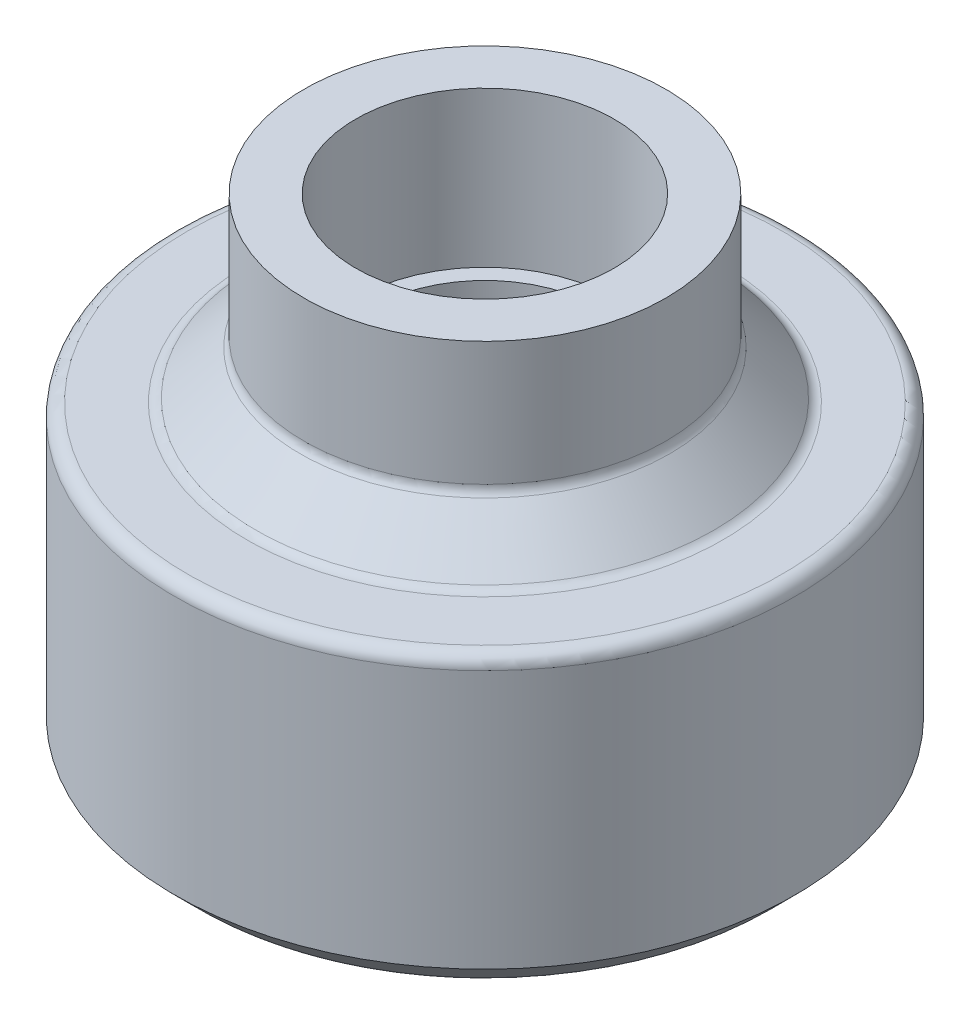
ISO-10303-21;
HEADER;
FILE_DESCRIPTION(('STEP AP214'),'2;1');
FILE_NAME('part.step','',(''),(''),'','','');
FILE_SCHEMA(('AUTOMOTIVE_DESIGN { 1 0 10303 214 1 1 1 1 }'));
ENDSEC;
DATA;
#1=APPLICATION_CONTEXT('core data for automotive mechanical design processes');
#2=APPLICATION_PROTOCOL_DEFINITION('international standard','automotive_design',2000,#1);
#3=PRODUCT_CONTEXT('',#1,'mechanical');
#4=PRODUCT('Part','Part','',(#3));
#5=PRODUCT_RELATED_PRODUCT_CATEGORY('part','',(#4));
#6=PRODUCT_DEFINITION_FORMATION('','',#4);
#7=PRODUCT_DEFINITION_CONTEXT('part definition',#1,'design');
#8=PRODUCT_DEFINITION('design','',#6,#7);
#9=PRODUCT_DEFINITION_SHAPE('','',#8);
#10=(LENGTH_UNIT() NAMED_UNIT(*) SI_UNIT(.MILLI.,.METRE.));
#11=(NAMED_UNIT(*) PLANE_ANGLE_UNIT() SI_UNIT($,.RADIAN.));
#12=(NAMED_UNIT(*) SI_UNIT($,.STERADIAN.) SOLID_ANGLE_UNIT());
#13=UNCERTAINTY_MEASURE_WITH_UNIT(LENGTH_MEASURE(1.E-05),#10,'distance_accuracy_value','');
#14=(GEOMETRIC_REPRESENTATION_CONTEXT(3) GLOBAL_UNCERTAINTY_ASSIGNED_CONTEXT((#13)) GLOBAL_UNIT_ASSIGNED_CONTEXT((#10,
#11,#12)) REPRESENTATION_CONTEXT('',''));
#15=CARTESIAN_POINT('',(0.,0.,0.));
#16=DIRECTION('',(0.,0.,1.));
#17=DIRECTION('',(1.,0.,0.));
#18=AXIS2_PLACEMENT_3D('',#15,#16,#17);
#19=CARTESIAN_POINT('',(0.,0.,0.));
#20=DIRECTION('',(0.,1.,0.));
#21=DIRECTION('',(-1.,0.,0.));
#22=AXIS2_PLACEMENT_3D('',#19,#20,#21);
#23=PLANE('',#22);
#24=CARTESIAN_POINT('',(0.,0.,0.));
#25=DIRECTION('',(0.,1.,0.));
#26=DIRECTION('',(0.,0.,1.));
#27=AXIS2_PLACEMENT_3D('',#24,#25,#26);
#28=CIRCLE('',#27,5.55625);
#29=CARTESIAN_POINT('',(0.,0.,5.55625));
#30=VERTEX_POINT('',#29);
#31=EDGE_CURVE('E81',#30,#30,#28,.T.);
#32=ORIENTED_EDGE('',*,*,#31,.F.);
#33=EDGE_LOOP('',(#32));
#34=FACE_BOUND('',#33,.T.);
#35=CARTESIAN_POINT('',(0.,0.,0.));
#36=DIRECTION('',(0.,-1.,0.));
#37=DIRECTION('',(1.,0.,0.));
#38=AXIS2_PLACEMENT_3D('',#35,#36,#37);
#39=CIRCLE('',#38,6.35);
#40=CARTESIAN_POINT('',(6.35,0.,0.));
#41=VERTEX_POINT('',#40);
#42=EDGE_CURVE('E72',#41,#41,#39,.T.);
#43=ORIENTED_EDGE('',*,*,#42,.F.);
#44=EDGE_LOOP('',(#43));
#45=FACE_BOUND('',#44,.T.);
#46=ADVANCED_FACE('F37',(#34,#45),#23,.T.);
#47=CARTESIAN_POINT('',(0.,-1033.0200000001,0.));
#48=DIRECTION('',(0.,-1.,0.));
#49=DIRECTION('',(1.,0.,0.));
#50=AXIS2_PLACEMENT_3D('',#47,#48,#49);
#51=CYLINDRICAL_SURFACE('',#50,6.35);
#52=ORIENTED_EDGE('',*,*,#42,.T.);
#53=EDGE_LOOP('',(#52));
#54=FACE_BOUND('',#53,.T.);
#55=CARTESIAN_POINT('',(0.,7.61999999999996,0.));
#56=DIRECTION('',(0.,-1.,0.));
#57=DIRECTION('',(1.,0.,0.));
#58=AXIS2_PLACEMENT_3D('',#55,#56,#57);
#59=CIRCLE('',#58,6.35);
#60=CARTESIAN_POINT('',(6.35,7.61999999999996,0.));
#61=VERTEX_POINT('',#60);
#62=EDGE_CURVE('E75',#61,#61,#59,.T.);
#63=ORIENTED_EDGE('',*,*,#62,.F.);
#64=EDGE_LOOP('',(#63));
#65=FACE_BOUND('',#64,.T.);
#66=ADVANCED_FACE('F109',(#54,#65),#51,.F.);
#67=CARTESIAN_POINT('',(6.35,7.62,0.));
#68=DIRECTION('',(0.,1.,0.));
#69=DIRECTION('',(-1.,0.,0.));
#70=AXIS2_PLACEMENT_3D('',#67,#68,#69);
#71=PLANE('',#70);
#72=ORIENTED_EDGE('',*,*,#62,.T.);
#73=EDGE_LOOP('',(#72));
#74=FACE_BOUND('',#73,.T.);
#75=CARTESIAN_POINT('',(0.,7.61999999999996,0.));
#76=DIRECTION('',(0.,-1.,0.));
#77=DIRECTION('',(1.,0.,0.));
#78=AXIS2_PLACEMENT_3D('',#75,#76,#77);
#79=CIRCLE('',#78,8.89);
#80=CARTESIAN_POINT('',(8.89,7.61999999999996,0.));
#81=VERTEX_POINT('',#80);
#82=EDGE_CURVE('E78',#81,#81,#79,.T.);
#83=ORIENTED_EDGE('',*,*,#82,.F.);
#84=EDGE_LOOP('',(#83));
#85=FACE_BOUND('',#84,.T.);
#86=ADVANCED_FACE('F115',(#74,#85),#71,.T.);
#87=CARTESIAN_POINT('',(0.,-1033.0200000001,0.));
#88=DIRECTION('',(0.,-1.,0.));
#89=DIRECTION('',(1.,0.,0.));
#90=AXIS2_PLACEMENT_3D('',#87,#88,#89);
#91=CYLINDRICAL_SURFACE('',#90,8.89);
#92=CARTESIAN_POINT('',(0.,1.53302561210711,0.));
#93=DIRECTION('',(0.,-1.,0.));
#94=DIRECTION('',(1.,0.,0.));
#95=AXIS2_PLACEMENT_3D('',#92,#93,#94);
#96=CIRCLE('',#95,8.89);
#97=CARTESIAN_POINT('',(8.89,1.53302561210711,0.));
#98=VERTEX_POINT('',#97);
#99=EDGE_CURVE('E60',#98,#98,#96,.F.);
#100=ORIENTED_EDGE('',*,*,#99,.T.);
#101=EDGE_LOOP('',(#100));
#102=FACE_BOUND('',#101,.T.);
#103=ORIENTED_EDGE('',*,*,#82,.T.);
#104=EDGE_LOOP('',(#103));
#105=FACE_BOUND('',#104,.T.);
#106=ADVANCED_FACE('F150',(#102,#105),#91,.T.);
#107=CARTESIAN_POINT('',(0.,-1.2700000000001,0.));
#108=DIRECTION('',(0.,-1.,0.));
#109=DIRECTION('',(1.,0.,0.));
#110=AXIS2_PLACEMENT_3D('',#107,#108,#109);
#111=CONICAL_SURFACE('',#110,11.43,0.785398163397407);
#112=CARTESIAN_POINT('',(0.,1.08401280605362,0.));
#113=DIRECTION('',(0.,-1.,0.));
#114=DIRECTION('',(1.,0.,0.));
#115=AXIS2_PLACEMENT_3D('',#112,#113,#114);
#116=CIRCLE('',#115,9.07598719394647);
#117=CARTESIAN_POINT('',(9.07598719394647,1.08401280605362,0.));
#118=VERTEX_POINT('',#117);
#119=EDGE_CURVE('E63',#118,#118,#116,.T.);
#120=ORIENTED_EDGE('',*,*,#119,.T.);
#121=EDGE_LOOP('',(#120));
#122=FACE_BOUND('',#121,.T.);
#123=CARTESIAN_POINT('',(0.,-1.08401280605344,0.));
#124=DIRECTION('',(0.,-1.,0.));
#125=DIRECTION('',(1.,0.,0.));
#126=AXIS2_PLACEMENT_3D('',#123,#124,#125);
#127=CIRCLE('',#126,11.2440128060534);
#128=CARTESIAN_POINT('',(11.2440128060534,-1.08401280605344,0.));
#129=VERTEX_POINT('',#128);
#130=EDGE_CURVE('E66',#129,#129,#127,.F.);
#131=ORIENTED_EDGE('',*,*,#130,.T.);
#132=EDGE_LOOP('',(#131));
#133=FACE_BOUND('',#132,.T.);
#134=ADVANCED_FACE('F144',(#122,#133),#111,.T.);
#135=CARTESIAN_POINT('',(11.43,-1.27,0.));
#136=DIRECTION('',(0.,1.,0.));
#137=DIRECTION('',(-1.,0.,0.));
#138=AXIS2_PLACEMENT_3D('',#135,#136,#137);
#139=PLANE('',#138);
#140=CARTESIAN_POINT('',(0.,-1.27,0.));
#141=DIRECTION('',(0.,1.,0.));
#142=DIRECTION('',(-1.,0.,0.));
#143=AXIS2_PLACEMENT_3D('',#140,#141,#142);
#144=CIRCLE('',#143,14.605);
#145=CARTESIAN_POINT('',(-14.605,-1.27,0.));
#146=VERTEX_POINT('',#145);
#147=EDGE_CURVE('E49',#146,#146,#144,.T.);
#148=ORIENTED_EDGE('',*,*,#147,.T.);
#149=EDGE_LOOP('',(#148));
#150=FACE_BOUND('',#149,.T.);
#151=CARTESIAN_POINT('',(0.,-1.27,0.));
#152=DIRECTION('',(0.,1.,0.));
#153=DIRECTION('',(-1.,0.,0.));
#154=AXIS2_PLACEMENT_3D('',#151,#152,#153);
#155=CIRCLE('',#154,11.6930256121068);
#156=CARTESIAN_POINT('',(-11.6930256121068,-1.27,0.));
#157=VERTEX_POINT('',#156);
#158=EDGE_CURVE('E54',#157,#157,#155,.F.);
#159=ORIENTED_EDGE('',*,*,#158,.T.);
#160=EDGE_LOOP('',(#159));
#161=FACE_BOUND('',#160,.T.);
#162=ADVANCED_FACE('F137',(#150,#161),#139,.T.);
#163=CARTESIAN_POINT('',(0.,-1033.0200000001,0.));
#164=DIRECTION('',(0.,-1.,0.));
#165=DIRECTION('',(1.,0.,0.));
#166=AXIS2_PLACEMENT_3D('',#163,#164,#165);
#167=CYLINDRICAL_SURFACE('',#166,15.24);
#168=CARTESIAN_POINT('',(0.,-1.90500000000005,0.));
#169=DIRECTION('',(0.,1.,0.));
#170=DIRECTION('',(-1.,0.,0.));
#171=AXIS2_PLACEMENT_3D('',#168,#169,#170);
#172=CIRCLE('',#171,15.24);
#173=CARTESIAN_POINT('',(-15.24,-1.90500000000005,0.));
#174=VERTEX_POINT('',#173);
#175=EDGE_CURVE('E57',#174,#174,#172,.F.);
#176=ORIENTED_EDGE('',*,*,#175,.T.);
#177=EDGE_LOOP('',(#176));
#178=FACE_BOUND('',#177,.T.);
#179=CARTESIAN_POINT('',(0.,-14.605,0.));
#180=DIRECTION('',(0.,-1.,0.));
#181=DIRECTION('',(1.,0.,0.));
#182=AXIS2_PLACEMENT_3D('',#179,#180,#181);
#183=CIRCLE('',#182,15.24);
#184=CARTESIAN_POINT('',(-15.24,-14.605,0.));
#185=VERTEX_POINT('',#184);
#186=EDGE_CURVE('E69',#185,#185,#183,.F.);
#187=ORIENTED_EDGE('',*,*,#186,.T.);
#188=EDGE_LOOP('',(#187));
#189=FACE_BOUND('',#188,.T.);
#190=ADVANCED_FACE('F94',(#178,#189),#167,.T.);
#191=CARTESIAN_POINT('',(0.,-5.83706885916513,0.));
#192=DIRECTION('',(0.,-1.,0.));
#193=DIRECTION('',(1.,0.,0.));
#194=AXIS2_PLACEMENT_3D('',#191,#192,#193);
#195=CONICAL_SURFACE('',#194,0.,0.918401990642502);
#196=CARTESIAN_POINT('',(0.,-10.0819846538154,0.));
#197=DIRECTION('',(0.,-1.,0.));
#198=DIRECTION('',(1.,0.,0.));
#199=AXIS2_PLACEMENT_3D('',#196,#197,#198);
#200=CIRCLE('',#199,5.55625);
#201=CARTESIAN_POINT('',(5.55625,-10.0819846538154,0.));
#202=VERTEX_POINT('',#201);
#203=EDGE_CURVE('E41',#202,#202,#200,.T.);
#204=ORIENTED_EDGE('',*,*,#203,.F.);
#205=EDGE_LOOP('',(#204));
#206=FACE_BOUND('',#205,.T.);
#207=CARTESIAN_POINT('',(0.,-15.8976195984611,0.));
#208=DIRECTION('',(0.,1.,0.));
#209=DIRECTION('',(-1.,0.,0.));
#210=AXIS2_PLACEMENT_3D('',#207,#208,#209);
#211=CIRCLE('',#210,13.1684437923742);
#212=CARTESIAN_POINT('',(-13.1684437923742,-15.8976195984611,0.));
#213=VERTEX_POINT('',#212);
#214=EDGE_CURVE('E45',#213,#213,#211,.F.);
#215=ORIENTED_EDGE('',*,*,#214,.T.);
#216=EDGE_LOOP('',(#215));
#217=FACE_BOUND('',#216,.T.);
#218=ADVANCED_FACE('F90',(#206,#217),#195,.F.);
#219=CARTESIAN_POINT('',(0.,-16.51,0.));
#220=DIRECTION('',(0.,1.,0.));
#221=DIRECTION('',(-1.,0.,0.));
#222=AXIS2_PLACEMENT_3D('',#219,#220,#221);
#223=CONICAL_SURFACE('',#222,13.335,0.785398163397445);
#224=CARTESIAN_POINT('',(0.,-15.8420407680739,0.));
#225=DIRECTION('',(0.,-1.,0.));
#226=DIRECTION('',(1.,0.,0.));
#227=AXIS2_PLACEMENT_3D('',#224,#225,#226);
#228=CIRCLE('',#227,14.002959231926);
#229=CARTESIAN_POINT('',(-14.0029592319261,-15.8420407680739,0.));
#230=VERTEX_POINT('',#229);
#231=EDGE_CURVE('E10',#230,#230,#228,.F.);
#232=CARTESIAN_POINT('',(-14.0029592319261,-15.8420407680739,0.));
#233=CARTESIAN_POINT('',(-14.0158450732602,-15.8291549267398,0.));
#234=CARTESIAN_POINT('',(-14.0287309145943,-15.8162690854057,0.));
#235=CARTESIAN_POINT('',(-14.0545025972625,-15.7904974027375,0.));
#236=CARTESIAN_POINT('',(-14.0673884385966,-15.7776115614034,0.));
#237=CARTESIAN_POINT('',(-14.0931601212648,-15.7518398787352,0.));
#238=CARTESIAN_POINT('',(-14.1060459625989,-15.7389540374011,0.));
#239=CARTESIAN_POINT('',(-14.1318176452671,-15.7131823547329,0.));
#240=CARTESIAN_POINT('',(-14.1447034866012,-15.7002965133988,0.));
#241=CARTESIAN_POINT('',(-14.1704751692694,-15.6745248307306,0.));
#242=CARTESIAN_POINT('',(-14.1833610106035,-15.6616389893965,0.));
#243=CARTESIAN_POINT('',(-14.2091326932717,-15.6358673067283,0.));
#244=CARTESIAN_POINT('',(-14.2220185346058,-15.6229814653942,0.));
#245=CARTESIAN_POINT('',(-14.247790217274,-15.597209782726,0.));
#246=CARTESIAN_POINT('',(-14.2606760586081,-15.5843239413919,0.));
#247=CARTESIAN_POINT('',(-14.2864477412763,-15.5585522587237,0.));
#248=CARTESIAN_POINT('',(-14.2993335826104,-15.5456664173896,0.));
#249=CARTESIAN_POINT('',(-14.3251052652786,-15.5198947347213,0.));
#250=CARTESIAN_POINT('',(-14.3379911066127,-15.5070088933872,0.));
#251=CARTESIAN_POINT('',(-14.363762789281,-15.481237210719,0.));
#252=CARTESIAN_POINT('',(-14.3766486306151,-15.4683513693849,0.));
#253=CARTESIAN_POINT('',(-14.4024203132833,-15.4425796867167,0.));
#254=CARTESIAN_POINT('',(-14.4153061546174,-15.4296938453826,0.));
#255=CARTESIAN_POINT('',(-14.4410778372856,-15.4039221627144,0.));
#256=CARTESIAN_POINT('',(-14.4539636786197,-15.3910363213803,0.));
#257=CARTESIAN_POINT('',(-14.4797353612879,-15.3652646387121,0.));
#258=CARTESIAN_POINT('',(-14.492621202622,-15.352378797378,0.));
#259=CARTESIAN_POINT('',(-14.5183928852902,-15.3266071147098,0.));
#260=CARTESIAN_POINT('',(-14.5312787266243,-15.3137212733757,0.));
#261=CARTESIAN_POINT('',(-14.5570504092925,-15.2879495907075,0.));
#262=CARTESIAN_POINT('',(-14.5699362506266,-15.2750637493734,0.));
#263=CARTESIAN_POINT('',(-14.5957079332948,-15.2492920667052,0.));
#264=CARTESIAN_POINT('',(-14.6085937746289,-15.2364062253711,0.));
#265=CARTESIAN_POINT('',(-14.6343654572971,-15.2106345427029,0.));
#266=CARTESIAN_POINT('',(-14.6472512986312,-15.1977487013688,0.));
#267=CARTESIAN_POINT('',(-14.6730229812994,-15.1719770187005,0.));
#268=CARTESIAN_POINT('',(-14.6859088226335,-15.1590911773664,0.));
#269=CARTESIAN_POINT('',(-14.7116805053018,-15.1333194946982,0.));
#270=CARTESIAN_POINT('',(-14.7245663466359,-15.1204336533641,0.));
#271=CARTESIAN_POINT('',(-14.7503380293041,-15.0946619706959,0.));
#272=CARTESIAN_POINT('',(-14.7632238706382,-15.0817761293618,0.));
#273=CARTESIAN_POINT('',(-14.7889955533064,-15.0560044466936,0.));
#274=CARTESIAN_POINT('',(-14.8018813946405,-15.0431186053595,0.));
#275=CARTESIAN_POINT('',(-14.8276530773087,-15.0173469226913,0.));
#276=CARTESIAN_POINT('',(-14.8405389186428,-15.0044610813572,0.));
#277=CARTESIAN_POINT('',(-14.866310601311,-14.978689398689,0.));
#278=CARTESIAN_POINT('',(-14.8791964426451,-14.9658035573549,0.));
#279=CARTESIAN_POINT('',(-14.9049681253133,-14.9400318746867,0.));
#280=CARTESIAN_POINT('',(-14.9178539666474,-14.9271460333526,0.));
#281=CARTESIAN_POINT('',(-14.9436256493156,-14.9013743506844,0.));
#282=CARTESIAN_POINT('',(-14.9565114906497,-14.8884885093503,0.));
#283=CARTESIAN_POINT('',(-14.9822831733179,-14.8627168266821,0.));
#284=CARTESIAN_POINT('',(-14.995169014652,-14.8498309853479,0.));
#285=CARTESIAN_POINT('',(-15.0209406973202,-14.8240593026797,0.));
#286=CARTESIAN_POINT('',(-15.0338265386543,-14.8111734613456,0.));
#287=CARTESIAN_POINT('',(-15.0595982213226,-14.7854017786774,0.));
#288=CARTESIAN_POINT('',(-15.0724840626567,-14.7725159373433,0.));
#289=CARTESIAN_POINT('',(-15.0982557453249,-14.7467442546751,0.));
#290=CARTESIAN_POINT('',(-15.111141586659,-14.733858413341,0.));
#291=CARTESIAN_POINT('',(-15.1369132693272,-14.7080867306728,0.));
#292=CARTESIAN_POINT('',(-15.1497991106613,-14.6952008893387,0.));
#293=CARTESIAN_POINT('',(-15.1755707933295,-14.6694292066705,0.));
#294=CARTESIAN_POINT('',(-15.1884566346636,-14.6565433653364,0.));
#295=CARTESIAN_POINT('',(-15.2142283173318,-14.6307716826682,0.));
#296=CARTESIAN_POINT('',(-15.2271141586659,-14.6178858413341,0.));
#297=CARTESIAN_POINT('',(-15.24,-14.605,0.));
#298=B_SPLINE_CURVE_WITH_KNOTS('',3,(#232,#233,#234,#235,#236,#237,#238,#239,#240,#241,#242,
#243,#244,#245,#246,#247,#248,#249,#250,#251,#252,#253,#254,#255,#256,#257,#258,#259,#260,#261,
#262,#263,#264,#265,#266,#267,#268,#269,#270,#271,#272,#273,#274,#275,#276,#277,#278,#279,#280,
#281,#282,#283,#284,#285,#286,#287,#288,#289,#290,#291,#292,#293,#294,#295,#296,#297),
.UNSPECIFIED.,.F.,.F.,(4,2,2,2,2,2,2,2,2,2,2,2,2,2,2,2,2,2,2,2,2,2,2,2,2,2,2,2,2,2,2,2,4),(0.,
0.054669994731832,0.109339989463663,0.164009984195495,0.218679978927324,0.273349973659156,
0.32801996839099,0.382689963122822,0.437359957854653,0.492029952586485,0.546699947318317,
0.601369942050149,0.656039936781981,0.710709931513813,0.765379926245645,0.820049920977477,
0.874719915709308,0.92938991044114,0.984059905172972,1.0387298999048,1.09339989463664,
1.14806988936847,1.2027398841003,1.25740987883213,1.31207987356396,1.3667498682958,
1.42141986302763,1.47608985775946,1.53075985249129,1.58542984722312,1.64009984195495,
1.69476983668679,1.74943983141862),.UNSPECIFIED.);
#299=EDGE_CURVE('BSEAM93',#230,#185,#298,.T.);
#300=ORIENTED_EDGE('',*,*,#231,.T.);
#301=ORIENTED_EDGE('',*,*,#186,.F.);
#302=ORIENTED_EDGE('',*,*,#299,.T.);
#303=ORIENTED_EDGE('',*,*,#299,.F.);
#304=EDGE_LOOP('',(#300,#302,#301,#303));
#305=FACE_BOUND('',#304,.T.);
#306=ADVANCED_FACE('F93',(#305),#223,.T.);
#307=CARTESIAN_POINT('',(0.,1.53302561210711,0.));
#308=DIRECTION('',(0.,-1.,0.));
#309=DIRECTION('',(1.,0.,0.));
#310=AXIS2_PLACEMENT_3D('',#307,#308,#309);
#311=TOROIDAL_SURFACE('',#310,9.525,0.635);
#312=ORIENTED_EDGE('',*,*,#99,.F.);
#313=EDGE_LOOP('',(#312));
#314=FACE_BOUND('',#313,.T.);
#315=ORIENTED_EDGE('',*,*,#119,.F.);
#316=EDGE_LOOP('',(#315));
#317=FACE_BOUND('',#316,.T.);
#318=ADVANCED_FACE('F123',(#314,#317),#311,.F.);
#319=CARTESIAN_POINT('',(0.,-1.90500000000005,0.));
#320=DIRECTION('',(0.,1.,0.));
#321=DIRECTION('',(-1.,0.,0.));
#322=AXIS2_PLACEMENT_3D('',#319,#320,#321);
#323=TOROIDAL_SURFACE('',#322,14.605,0.635);
#324=ORIENTED_EDGE('',*,*,#147,.F.);
#325=EDGE_LOOP('',(#324));
#326=FACE_BOUND('',#325,.T.);
#327=ORIENTED_EDGE('',*,*,#175,.F.);
#328=EDGE_LOOP('',(#327));
#329=FACE_BOUND('',#328,.T.);
#330=ADVANCED_FACE('F106',(#326,#329),#323,.T.);
#331=CARTESIAN_POINT('',(0.,-0.635000000000003,0.));
#332=DIRECTION('',(0.,1.,0.));
#333=DIRECTION('',(-1.,0.,0.));
#334=AXIS2_PLACEMENT_3D('',#331,#332,#333);
#335=TOROIDAL_SURFACE('',#334,11.6930256121068,0.635);
#336=ORIENTED_EDGE('',*,*,#130,.F.);
#337=EDGE_LOOP('',(#336));
#338=FACE_BOUND('',#337,.T.);
#339=ORIENTED_EDGE('',*,*,#158,.F.);
#340=EDGE_LOOP('',(#339));
#341=FACE_BOUND('',#340,.T.);
#342=ADVANCED_FACE('F99',(#338,#341),#335,.F.);
#343=CARTESIAN_POINT('',(0.,-15.3930279620205,0.));
#344=DIRECTION('',(0.,1.,0.));
#345=DIRECTION('',(-1.,0.,0.));
#346=AXIS2_PLACEMENT_3D('',#343,#344,#345);
#347=TOROIDAL_SURFACE('',#346,13.5539464258726,0.635);
#348=ORIENTED_EDGE('',*,*,#231,.F.);
#349=EDGE_LOOP('',(#348));
#350=FACE_BOUND('',#349,.T.);
#351=ORIENTED_EDGE('',*,*,#214,.F.);
#352=EDGE_LOOP('',(#351));
#353=FACE_BOUND('',#352,.T.);
#354=ADVANCED_FACE('F39',(#350,#353),#347,.T.);
#355=CARTESIAN_POINT('',(0.,0.,0.));
#356=DIRECTION('',(0.,1.,0.));
#357=DIRECTION('',(0.,0.,1.));
#358=AXIS2_PLACEMENT_3D('',#355,#356,#357);
#359=CYLINDRICAL_SURFACE('',#358,5.55625);
#360=ORIENTED_EDGE('',*,*,#203,.T.);
#361=EDGE_LOOP('',(#360));
#362=FACE_BOUND('',#361,.T.);
#363=ORIENTED_EDGE('',*,*,#31,.T.);
#364=EDGE_LOOP('',(#363));
#365=FACE_BOUND('',#364,.T.);
#366=ADVANCED_FACE('F88',(#362,#365),#359,.F.);
#367=CLOSED_SHELL('',(#46,#66,#86,#106,#134,#162,#190,#218,#306,#318,#330,#342,#354,#366));
#368=MANIFOLD_SOLID_BREP('B2',#367);
#369=ADVANCED_BREP_SHAPE_REPRESENTATION('',(#18,#368),#14);
#370=SHAPE_DEFINITION_REPRESENTATION(#9,#369);
ENDSEC;
END-ISO-10303-21;
